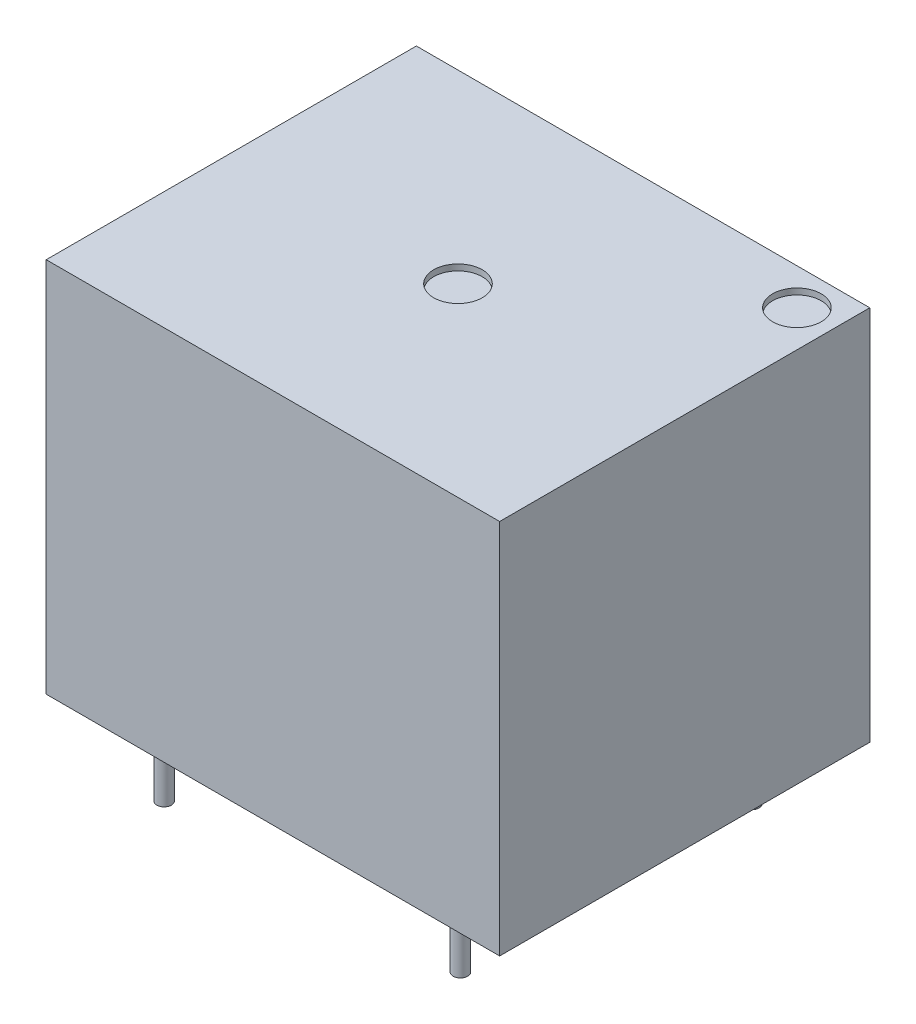
ISO-10303-21;
HEADER;
FILE_DESCRIPTION(('STEP AP214'),'2;1');
FILE_NAME('part.step','',(''),(''),'','','');
FILE_SCHEMA(('AUTOMOTIVE_DESIGN { 1 0 10303 214 1 1 1 1 }'));
ENDSEC;
DATA;
#1=APPLICATION_CONTEXT('core data for automotive mechanical design processes');
#2=APPLICATION_PROTOCOL_DEFINITION('international standard','automotive_design',2000,#1);
#3=PRODUCT_CONTEXT('',#1,'mechanical');
#4=PRODUCT('Part','Part','',(#3));
#5=PRODUCT_RELATED_PRODUCT_CATEGORY('part','',(#4));
#6=PRODUCT_DEFINITION_FORMATION('','',#4);
#7=PRODUCT_DEFINITION_CONTEXT('part definition',#1,'design');
#8=PRODUCT_DEFINITION('design','',#6,#7);
#9=PRODUCT_DEFINITION_SHAPE('','',#8);
#10=(LENGTH_UNIT() NAMED_UNIT(*) SI_UNIT(.MILLI.,.METRE.));
#11=(NAMED_UNIT(*) PLANE_ANGLE_UNIT() SI_UNIT($,.RADIAN.));
#12=(NAMED_UNIT(*) SI_UNIT($,.STERADIAN.) SOLID_ANGLE_UNIT());
#13=UNCERTAINTY_MEASURE_WITH_UNIT(LENGTH_MEASURE(1.E-05),#10,'distance_accuracy_value','');
#14=(GEOMETRIC_REPRESENTATION_CONTEXT(3) GLOBAL_UNCERTAINTY_ASSIGNED_CONTEXT((#13)) GLOBAL_UNIT_ASSIGNED_CONTEXT((#10,
#11,#12)) REPRESENTATION_CONTEXT('',''));
#15=CARTESIAN_POINT('',(0.,0.,0.));
#16=DIRECTION('',(0.,0.,1.));
#17=DIRECTION('',(1.,0.,0.));
#18=AXIS2_PLACEMENT_3D('',#15,#16,#17);
#19=CARTESIAN_POINT('',(6.1,-3.,-6.));
#20=DIRECTION('',(0.,1.,0.));
#21=DIRECTION('',(0.,0.,1.));
#22=AXIS2_PLACEMENT_3D('',#19,#20,#21);
#23=PLANE('',#22);
#24=CARTESIAN_POINT('',(6.1,-3.,-6.));
#25=DIRECTION('',(0.,1.,0.));
#26=DIRECTION('',(0.,0.,1.));
#27=AXIS2_PLACEMENT_3D('',#24,#25,#26);
#28=CIRCLE('',#27,0.3);
#29=CARTESIAN_POINT('',(6.1,-3.,-5.7));
#30=VERTEX_POINT('',#29);
#31=EDGE_CURVE('E19',#30,#30,#28,.T.);
#32=ORIENTED_EDGE('',*,*,#31,.F.);
#33=EDGE_LOOP('',(#32));
#34=FACE_BOUND('',#33,.T.);
#35=ADVANCED_FACE('F16',(#34),#23,.F.);
#36=CARTESIAN_POINT('',(6.1,-3.,6.));
#37=DIRECTION('',(0.,1.,0.));
#38=DIRECTION('',(0.,0.,1.));
#39=AXIS2_PLACEMENT_3D('',#36,#37,#38);
#40=PLANE('',#39);
#41=CARTESIAN_POINT('',(6.1,-3.,6.));
#42=DIRECTION('',(0.,1.,0.));
#43=DIRECTION('',(0.,0.,1.));
#44=AXIS2_PLACEMENT_3D('',#41,#42,#43);
#45=CIRCLE('',#44,0.3);
#46=CARTESIAN_POINT('',(6.1,-3.,6.3));
#47=VERTEX_POINT('',#46);
#48=EDGE_CURVE('E117',#47,#47,#45,.T.);
#49=ORIENTED_EDGE('',*,*,#48,.F.);
#50=EDGE_LOOP('',(#49));
#51=FACE_BOUND('',#50,.T.);
#52=ADVANCED_FACE('F127',(#51),#40,.F.);
#53=CARTESIAN_POINT('',(-6.1,-3.,6.));
#54=DIRECTION('',(0.,1.,0.));
#55=DIRECTION('',(0.,0.,1.));
#56=AXIS2_PLACEMENT_3D('',#53,#54,#55);
#57=PLANE('',#56);
#58=CARTESIAN_POINT('',(-6.1,-3.,6.));
#59=DIRECTION('',(0.,1.,0.));
#60=DIRECTION('',(0.,0.,1.));
#61=AXIS2_PLACEMENT_3D('',#58,#59,#60);
#62=CIRCLE('',#61,0.3);
#63=CARTESIAN_POINT('',(-6.1,-3.,6.3));
#64=VERTEX_POINT('',#63);
#65=EDGE_CURVE('E115',#64,#64,#62,.T.);
#66=ORIENTED_EDGE('',*,*,#65,.F.);
#67=EDGE_LOOP('',(#66));
#68=FACE_BOUND('',#67,.T.);
#69=ADVANCED_FACE('F132',(#68),#57,.F.);
#70=CARTESIAN_POINT('',(-6.1,-3.,-6.));
#71=DIRECTION('',(0.,1.,0.));
#72=DIRECTION('',(0.,0.,1.));
#73=AXIS2_PLACEMENT_3D('',#70,#71,#72);
#74=PLANE('',#73);
#75=CARTESIAN_POINT('',(-6.1,-3.,-6.));
#76=DIRECTION('',(0.,1.,0.));
#77=DIRECTION('',(0.,0.,1.));
#78=AXIS2_PLACEMENT_3D('',#75,#76,#77);
#79=CIRCLE('',#78,0.3);
#80=CARTESIAN_POINT('',(-6.1,-3.,-5.7));
#81=VERTEX_POINT('',#80);
#82=EDGE_CURVE('E112',#81,#81,#79,.T.);
#83=ORIENTED_EDGE('',*,*,#82,.F.);
#84=EDGE_LOOP('',(#83));
#85=FACE_BOUND('',#84,.T.);
#86=ADVANCED_FACE('F194',(#85),#74,.F.);
#87=CARTESIAN_POINT('',(-8.1,-3.,0.));
#88=DIRECTION('',(0.,1.,0.));
#89=DIRECTION('',(0.,0.,1.));
#90=AXIS2_PLACEMENT_3D('',#87,#88,#89);
#91=PLANE('',#90);
#92=CARTESIAN_POINT('',(-8.1,-3.,0.));
#93=DIRECTION('',(0.,1.,0.));
#94=DIRECTION('',(0.,0.,1.));
#95=AXIS2_PLACEMENT_3D('',#92,#93,#94);
#96=CIRCLE('',#95,0.3);
#97=CARTESIAN_POINT('',(-8.1,-3.,0.300000000000001));
#98=VERTEX_POINT('',#97);
#99=EDGE_CURVE('E109',#98,#98,#96,.T.);
#100=ORIENTED_EDGE('',*,*,#99,.F.);
#101=EDGE_LOOP('',(#100));
#102=FACE_BOUND('',#101,.T.);
#103=ADVANCED_FACE('F190',(#102),#91,.F.);
#104=CARTESIAN_POINT('',(7.8345,15.244,-6.12));
#105=DIRECTION('',(0.,1.,0.));
#106=DIRECTION('',(0.,0.,1.));
#107=AXIS2_PLACEMENT_3D('',#104,#105,#106);
#108=PLANE('',#107);
#109=CARTESIAN_POINT('',(7.8345,15.244,-6.12));
#110=DIRECTION('',(0.,1.,0.));
#111=DIRECTION('',(0.,0.,1.));
#112=AXIS2_PLACEMENT_3D('',#109,#110,#111);
#113=CIRCLE('',#112,1.);
#114=CARTESIAN_POINT('',(7.8345,15.244,-5.12));
#115=VERTEX_POINT('',#114);
#116=EDGE_CURVE('E106',#115,#115,#113,.T.);
#117=ORIENTED_EDGE('',*,*,#116,.T.);
#118=EDGE_LOOP('',(#117));
#119=FACE_BOUND('',#118,.T.);
#120=ADVANCED_FACE('F186',(#119),#108,.T.);
#121=CARTESIAN_POINT('',(0.,15.244,0.));
#122=DIRECTION('',(0.,1.,0.));
#123=DIRECTION('',(0.,0.,1.));
#124=AXIS2_PLACEMENT_3D('',#121,#122,#123);
#125=PLANE('',#124);
#126=CARTESIAN_POINT('',(0.,15.244,0.));
#127=DIRECTION('',(0.,1.,0.));
#128=DIRECTION('',(0.,0.,1.));
#129=AXIS2_PLACEMENT_3D('',#126,#127,#128);
#130=CIRCLE('',#129,1.);
#131=CARTESIAN_POINT('',(0.,15.244,1.));
#132=VERTEX_POINT('',#131);
#133=EDGE_CURVE('E103',#132,#132,#130,.T.);
#134=ORIENTED_EDGE('',*,*,#133,.T.);
#135=EDGE_LOOP('',(#134));
#136=FACE_BOUND('',#135,.T.);
#137=ADVANCED_FACE('F182',(#136),#125,.T.);
#138=CARTESIAN_POINT('',(6.1,-3.,-6.));
#139=DIRECTION('',(0.,1.,0.));
#140=DIRECTION('',(0.,0.,1.));
#141=AXIS2_PLACEMENT_3D('',#138,#139,#140);
#142=CYLINDRICAL_SURFACE('',#141,0.3);
#143=CARTESIAN_POINT('',(6.1,0.,-6.));
#144=DIRECTION('',(0.,1.,0.));
#145=DIRECTION('',(0.,0.,1.));
#146=AXIS2_PLACEMENT_3D('',#143,#144,#145);
#147=CIRCLE('',#146,0.3);
#148=CARTESIAN_POINT('',(6.1,0.,-5.7));
#149=VERTEX_POINT('',#148);
#150=EDGE_CURVE('E100',#149,#149,#147,.T.);
#151=ORIENTED_EDGE('',*,*,#150,.F.);
#152=EDGE_LOOP('',(#151));
#153=FACE_BOUND('',#152,.T.);
#154=ORIENTED_EDGE('',*,*,#31,.T.);
#155=EDGE_LOOP('',(#154));
#156=FACE_BOUND('',#155,.T.);
#157=ADVANCED_FACE('F124',(#153,#156),#142,.T.);
#158=CARTESIAN_POINT('',(6.1,-3.,6.));
#159=DIRECTION('',(0.,1.,0.));
#160=DIRECTION('',(0.,0.,1.));
#161=AXIS2_PLACEMENT_3D('',#158,#159,#160);
#162=CYLINDRICAL_SURFACE('',#161,0.3);
#163=CARTESIAN_POINT('',(6.1,0.,6.));
#164=DIRECTION('',(0.,1.,0.));
#165=DIRECTION('',(0.,0.,1.));
#166=AXIS2_PLACEMENT_3D('',#163,#164,#165);
#167=CIRCLE('',#166,0.3);
#168=CARTESIAN_POINT('',(6.1,0.,6.3));
#169=VERTEX_POINT('',#168);
#170=EDGE_CURVE('E97',#169,#169,#167,.T.);
#171=ORIENTED_EDGE('',*,*,#170,.F.);
#172=EDGE_LOOP('',(#171));
#173=FACE_BOUND('',#172,.T.);
#174=ORIENTED_EDGE('',*,*,#48,.T.);
#175=EDGE_LOOP('',(#174));
#176=FACE_BOUND('',#175,.T.);
#177=ADVANCED_FACE('F175',(#173,#176),#162,.T.);
#178=CARTESIAN_POINT('',(-6.1,-3.,6.));
#179=DIRECTION('',(0.,1.,0.));
#180=DIRECTION('',(0.,0.,1.));
#181=AXIS2_PLACEMENT_3D('',#178,#179,#180);
#182=CYLINDRICAL_SURFACE('',#181,0.3);
#183=CARTESIAN_POINT('',(-6.1,0.,6.));
#184=DIRECTION('',(0.,1.,0.));
#185=DIRECTION('',(0.,0.,1.));
#186=AXIS2_PLACEMENT_3D('',#183,#184,#185);
#187=CIRCLE('',#186,0.3);
#188=CARTESIAN_POINT('',(-6.1,0.,6.3));
#189=VERTEX_POINT('',#188);
#190=EDGE_CURVE('E94',#189,#189,#187,.T.);
#191=ORIENTED_EDGE('',*,*,#190,.F.);
#192=EDGE_LOOP('',(#191));
#193=FACE_BOUND('',#192,.T.);
#194=ORIENTED_EDGE('',*,*,#65,.T.);
#195=EDGE_LOOP('',(#194));
#196=FACE_BOUND('',#195,.T.);
#197=ADVANCED_FACE('F171',(#193,#196),#182,.T.);
#198=CARTESIAN_POINT('',(-6.1,-3.,-6.));
#199=DIRECTION('',(0.,1.,0.));
#200=DIRECTION('',(0.,0.,1.));
#201=AXIS2_PLACEMENT_3D('',#198,#199,#200);
#202=CYLINDRICAL_SURFACE('',#201,0.3);
#203=CARTESIAN_POINT('',(-6.1,0.,-6.));
#204=DIRECTION('',(0.,1.,0.));
#205=DIRECTION('',(0.,0.,1.));
#206=AXIS2_PLACEMENT_3D('',#203,#204,#205);
#207=CIRCLE('',#206,0.3);
#208=CARTESIAN_POINT('',(-6.1,0.,-5.7));
#209=VERTEX_POINT('',#208);
#210=EDGE_CURVE('E91',#209,#209,#207,.T.);
#211=ORIENTED_EDGE('',*,*,#210,.F.);
#212=EDGE_LOOP('',(#211));
#213=FACE_BOUND('',#212,.T.);
#214=ORIENTED_EDGE('',*,*,#82,.T.);
#215=EDGE_LOOP('',(#214));
#216=FACE_BOUND('',#215,.T.);
#217=ADVANCED_FACE('F167',(#213,#216),#202,.T.);
#218=CARTESIAN_POINT('',(-8.1,-3.,0.));
#219=DIRECTION('',(0.,1.,0.));
#220=DIRECTION('',(0.,0.,1.));
#221=AXIS2_PLACEMENT_3D('',#218,#219,#220);
#222=CYLINDRICAL_SURFACE('',#221,0.3);
#223=CARTESIAN_POINT('',(-8.1,0.,0.));
#224=DIRECTION('',(0.,1.,0.));
#225=DIRECTION('',(0.,0.,1.));
#226=AXIS2_PLACEMENT_3D('',#223,#224,#225);
#227=CIRCLE('',#226,0.3);
#228=CARTESIAN_POINT('',(-8.1,0.,0.300000000000001));
#229=VERTEX_POINT('',#228);
#230=EDGE_CURVE('E73',#229,#229,#227,.T.);
#231=ORIENTED_EDGE('',*,*,#230,.F.);
#232=EDGE_LOOP('',(#231));
#233=FACE_BOUND('',#232,.T.);
#234=ORIENTED_EDGE('',*,*,#99,.T.);
#235=EDGE_LOOP('',(#234));
#236=FACE_BOUND('',#235,.T.);
#237=ADVANCED_FACE('F163',(#233,#236),#222,.T.);
#238=CARTESIAN_POINT('',(7.8345,15.244,-6.12));
#239=DIRECTION('',(0.,1.,0.));
#240=DIRECTION('',(0.,0.,1.));
#241=AXIS2_PLACEMENT_3D('',#238,#239,#240);
#242=CYLINDRICAL_SURFACE('',#241,1.);
#243=ORIENTED_EDGE('',*,*,#116,.F.);
#244=EDGE_LOOP('',(#243));
#245=FACE_BOUND('',#244,.T.);
#246=CARTESIAN_POINT('',(7.8345,15.494,-6.12));
#247=DIRECTION('',(0.,1.,0.));
#248=DIRECTION('',(0.,0.,1.));
#249=AXIS2_PLACEMENT_3D('',#246,#247,#248);
#250=CIRCLE('',#249,1.);
#251=CARTESIAN_POINT('',(7.8345,15.494,-5.12));
#252=VERTEX_POINT('',#251);
#253=EDGE_CURVE('E79',#252,#252,#250,.T.);
#254=ORIENTED_EDGE('',*,*,#253,.T.);
#255=EDGE_LOOP('',(#254));
#256=FACE_BOUND('',#255,.T.);
#257=ADVANCED_FACE('F159',(#245,#256),#242,.F.);
#258=CARTESIAN_POINT('',(0.,15.244,0.));
#259=DIRECTION('',(0.,1.,0.));
#260=DIRECTION('',(0.,0.,1.));
#261=AXIS2_PLACEMENT_3D('',#258,#259,#260);
#262=CYLINDRICAL_SURFACE('',#261,1.);
#263=ORIENTED_EDGE('',*,*,#133,.F.);
#264=EDGE_LOOP('',(#263));
#265=FACE_BOUND('',#264,.T.);
#266=CARTESIAN_POINT('',(0.,15.494,0.));
#267=DIRECTION('',(0.,1.,0.));
#268=DIRECTION('',(0.,0.,1.));
#269=AXIS2_PLACEMENT_3D('',#266,#267,#268);
#270=CIRCLE('',#269,1.);
#271=CARTESIAN_POINT('',(0.,15.494,1.));
#272=VERTEX_POINT('',#271);
#273=EDGE_CURVE('E82',#272,#272,#270,.T.);
#274=ORIENTED_EDGE('',*,*,#273,.T.);
#275=EDGE_LOOP('',(#274));
#276=FACE_BOUND('',#275,.T.);
#277=ADVANCED_FACE('F156',(#265,#276),#262,.F.);
#278=CARTESIAN_POINT('',(-9.3345,15.494,7.62));
#279=DIRECTION('',(0.,0.,-1.));
#280=DIRECTION('',(-1.,0.,0.));
#281=AXIS2_PLACEMENT_3D('',#278,#279,#280);
#282=PLANE('',#281);
#283=DIRECTION('',(0.,1.,0.));
#284=VECTOR('',#283,1.);
#285=CARTESIAN_POINT('',(9.3345,15.494,7.62));
#286=LINE('',#285,#284);
#287=CARTESIAN_POINT('',(9.3345,15.494,7.62));
#288=VERTEX_POINT('',#287);
#289=CARTESIAN_POINT('',(9.3345,0.,7.62));
#290=VERTEX_POINT('',#289);
#291=EDGE_CURVE('E413',#288,#290,#286,.F.);
#292=ORIENTED_EDGE('',*,*,#291,.F.);
#293=DIRECTION('',(1.,0.,0.));
#294=VECTOR('',#293,1.);
#295=CARTESIAN_POINT('',(0.,15.494,7.62));
#296=LINE('',#295,#294);
#297=CARTESIAN_POINT('',(-9.3345,15.494,7.62));
#298=VERTEX_POINT('',#297);
#299=EDGE_CURVE('E54',#288,#298,#296,.F.);
#300=ORIENTED_EDGE('',*,*,#299,.T.);
#301=DIRECTION('',(0.,1.,0.));
#302=VECTOR('',#301,1.);
#303=CARTESIAN_POINT('',(-9.3345,15.494,7.62));
#304=LINE('',#303,#302);
#305=CARTESIAN_POINT('',(-9.3345,0.,7.62));
#306=VERTEX_POINT('',#305);
#307=EDGE_CURVE('E56',#298,#306,#304,.F.);
#308=ORIENTED_EDGE('',*,*,#307,.T.);
#309=DIRECTION('',(1.,0.,0.));
#310=VECTOR('',#309,1.);
#311=CARTESIAN_POINT('',(0.,0.,7.62));
#312=LINE('',#311,#310);
#313=EDGE_CURVE('E59',#290,#306,#312,.F.);
#314=ORIENTED_EDGE('',*,*,#313,.F.);
#315=EDGE_LOOP('',(#292,#300,#308,#314));
#316=FACE_BOUND('',#315,.T.);
#317=ADVANCED_FACE('F58',(#316),#282,.F.);
#318=CARTESIAN_POINT('',(0.,0.,0.));
#319=DIRECTION('',(0.,-1.,0.));
#320=DIRECTION('',(0.,0.,-1.));
#321=AXIS2_PLACEMENT_3D('',#318,#319,#320);
#322=PLANE('',#321);
#323=ORIENTED_EDGE('',*,*,#313,.T.);
#324=DIRECTION('',(0.,0.,-1.));
#325=VECTOR('',#324,1.);
#326=CARTESIAN_POINT('',(-9.3345,0.,-7.62));
#327=LINE('',#326,#325);
#328=CARTESIAN_POINT('',(-9.3345,0.,-7.62));
#329=VERTEX_POINT('',#328);
#330=EDGE_CURVE('E64',#306,#329,#327,.T.);
#331=ORIENTED_EDGE('',*,*,#330,.T.);
#332=DIRECTION('',(-1.,0.,0.));
#333=VECTOR('',#332,1.);
#334=CARTESIAN_POINT('',(-9.3345,0.,-7.62));
#335=LINE('',#334,#333);
#336=CARTESIAN_POINT('',(9.3345,0.,-7.62));
#337=VERTEX_POINT('',#336);
#338=EDGE_CURVE('E415',#337,#329,#335,.T.);
#339=ORIENTED_EDGE('',*,*,#338,.F.);
#340=DIRECTION('',(0.,0.,-1.));
#341=VECTOR('',#340,1.);
#342=CARTESIAN_POINT('',(9.3345,0.,-7.62));
#343=LINE('',#342,#341);
#344=EDGE_CURVE('E71',#290,#337,#343,.T.);
#345=ORIENTED_EDGE('',*,*,#344,.F.);
#346=EDGE_LOOP('',(#323,#331,#339,#345));
#347=FACE_BOUND('',#346,.T.);
#348=ORIENTED_EDGE('',*,*,#230,.T.);
#349=EDGE_LOOP('',(#348));
#350=FACE_BOUND('',#349,.T.);
#351=ORIENTED_EDGE('',*,*,#210,.T.);
#352=EDGE_LOOP('',(#351));
#353=FACE_BOUND('',#352,.T.);
#354=ORIENTED_EDGE('',*,*,#190,.T.);
#355=EDGE_LOOP('',(#354));
#356=FACE_BOUND('',#355,.T.);
#357=ORIENTED_EDGE('',*,*,#170,.T.);
#358=EDGE_LOOP('',(#357));
#359=FACE_BOUND('',#358,.T.);
#360=ORIENTED_EDGE('',*,*,#150,.T.);
#361=EDGE_LOOP('',(#360));
#362=FACE_BOUND('',#361,.T.);
#363=ADVANCED_FACE('F67',(#347,#350,#353,#356,#359,#362),#322,.T.);
#364=CARTESIAN_POINT('',(-9.3345,15.494,-7.62));
#365=DIRECTION('',(1.,0.,0.));
#366=DIRECTION('',(0.,0.,-1.));
#367=AXIS2_PLACEMENT_3D('',#364,#365,#366);
#368=PLANE('',#367);
#369=ORIENTED_EDGE('',*,*,#307,.F.);
#370=DIRECTION('',(0.,0.,-1.));
#371=VECTOR('',#370,1.);
#372=CARTESIAN_POINT('',(-9.3345,15.494,0.));
#373=LINE('',#372,#371);
#374=CARTESIAN_POINT('',(-9.3345,15.494,-7.62));
#375=VERTEX_POINT('',#374);
#376=EDGE_CURVE('E409',#298,#375,#373,.T.);
#377=ORIENTED_EDGE('',*,*,#376,.T.);
#378=DIRECTION('',(0.,1.,0.));
#379=VECTOR('',#378,1.);
#380=CARTESIAN_POINT('',(-9.3345,15.494,-7.62));
#381=LINE('',#380,#379);
#382=EDGE_CURVE('E77',#329,#375,#381,.T.);
#383=ORIENTED_EDGE('',*,*,#382,.F.);
#384=ORIENTED_EDGE('',*,*,#330,.F.);
#385=EDGE_LOOP('',(#369,#377,#383,#384));
#386=FACE_BOUND('',#385,.T.);
#387=ADVANCED_FACE('F75',(#386),#368,.F.);
#388=CARTESIAN_POINT('',(0.,15.494,0.));
#389=DIRECTION('',(0.,-1.,0.));
#390=DIRECTION('',(0.,0.,-1.));
#391=AXIS2_PLACEMENT_3D('',#388,#389,#390);
#392=PLANE('',#391);
#393=ORIENTED_EDGE('',*,*,#376,.F.);
#394=ORIENTED_EDGE('',*,*,#299,.F.);
#395=DIRECTION('',(0.,0.,-1.));
#396=VECTOR('',#395,1.);
#397=CARTESIAN_POINT('',(9.3345,15.494,-7.62));
#398=LINE('',#397,#396);
#399=CARTESIAN_POINT('',(9.3345,15.494,-7.62));
#400=VERTEX_POINT('',#399);
#401=EDGE_CURVE('E34',#400,#288,#398,.F.);
#402=ORIENTED_EDGE('',*,*,#401,.F.);
#403=DIRECTION('',(-1.,0.,0.));
#404=VECTOR('',#403,1.);
#405=CARTESIAN_POINT('',(-9.3345,15.494,-7.62));
#406=LINE('',#405,#404);
#407=EDGE_CURVE('E25',#375,#400,#406,.F.);
#408=ORIENTED_EDGE('',*,*,#407,.F.);
#409=EDGE_LOOP('',(#393,#394,#402,#408));
#410=FACE_BOUND('',#409,.T.);
#411=ORIENTED_EDGE('',*,*,#273,.F.);
#412=EDGE_LOOP('',(#411));
#413=FACE_BOUND('',#412,.T.);
#414=ORIENTED_EDGE('',*,*,#253,.F.);
#415=EDGE_LOOP('',(#414));
#416=FACE_BOUND('',#415,.T.);
#417=ADVANCED_FACE('F143',(#410,#413,#416),#392,.F.);
#418=CARTESIAN_POINT('',(9.3345,15.494,-7.62));
#419=DIRECTION('',(1.,0.,0.));
#420=DIRECTION('',(0.,0.,-1.));
#421=AXIS2_PLACEMENT_3D('',#418,#419,#420);
#422=PLANE('',#421);
#423=ORIENTED_EDGE('',*,*,#401,.T.);
#424=ORIENTED_EDGE('',*,*,#291,.T.);
#425=ORIENTED_EDGE('',*,*,#344,.T.);
#426=DIRECTION('',(0.,1.,0.));
#427=VECTOR('',#426,1.);
#428=CARTESIAN_POINT('',(9.3345,15.494,-7.62));
#429=LINE('',#428,#427);
#430=EDGE_CURVE('E11',#400,#337,#429,.F.);
#431=ORIENTED_EDGE('',*,*,#430,.F.);
#432=EDGE_LOOP('',(#423,#424,#425,#431));
#433=FACE_BOUND('',#432,.T.);
#434=ADVANCED_FACE('F136',(#433),#422,.T.);
#435=CARTESIAN_POINT('',(-9.3345,15.494,-7.62));
#436=DIRECTION('',(0.,0.,-1.));
#437=DIRECTION('',(-1.,0.,0.));
#438=AXIS2_PLACEMENT_3D('',#435,#436,#437);
#439=PLANE('',#438);
#440=ORIENTED_EDGE('',*,*,#407,.T.);
#441=ORIENTED_EDGE('',*,*,#430,.T.);
#442=ORIENTED_EDGE('',*,*,#338,.T.);
#443=ORIENTED_EDGE('',*,*,#382,.T.);
#444=EDGE_LOOP('',(#440,#441,#442,#443));
#445=FACE_BOUND('',#444,.T.);
#446=ADVANCED_FACE('F134',(#445),#439,.T.);
#447=CLOSED_SHELL('',(#35,#52,#69,#86,#103,#120,#137,#157,#177,#197,#217,#237,#257,#277,#317,
#363,#387,#417,#434,#446));
#448=MANIFOLD_SOLID_BREP('B1',#447);
#449=ADVANCED_BREP_SHAPE_REPRESENTATION('',(#18,#448),#14);
#450=SHAPE_DEFINITION_REPRESENTATION(#9,#449);
ENDSEC;
END-ISO-10303-21;
